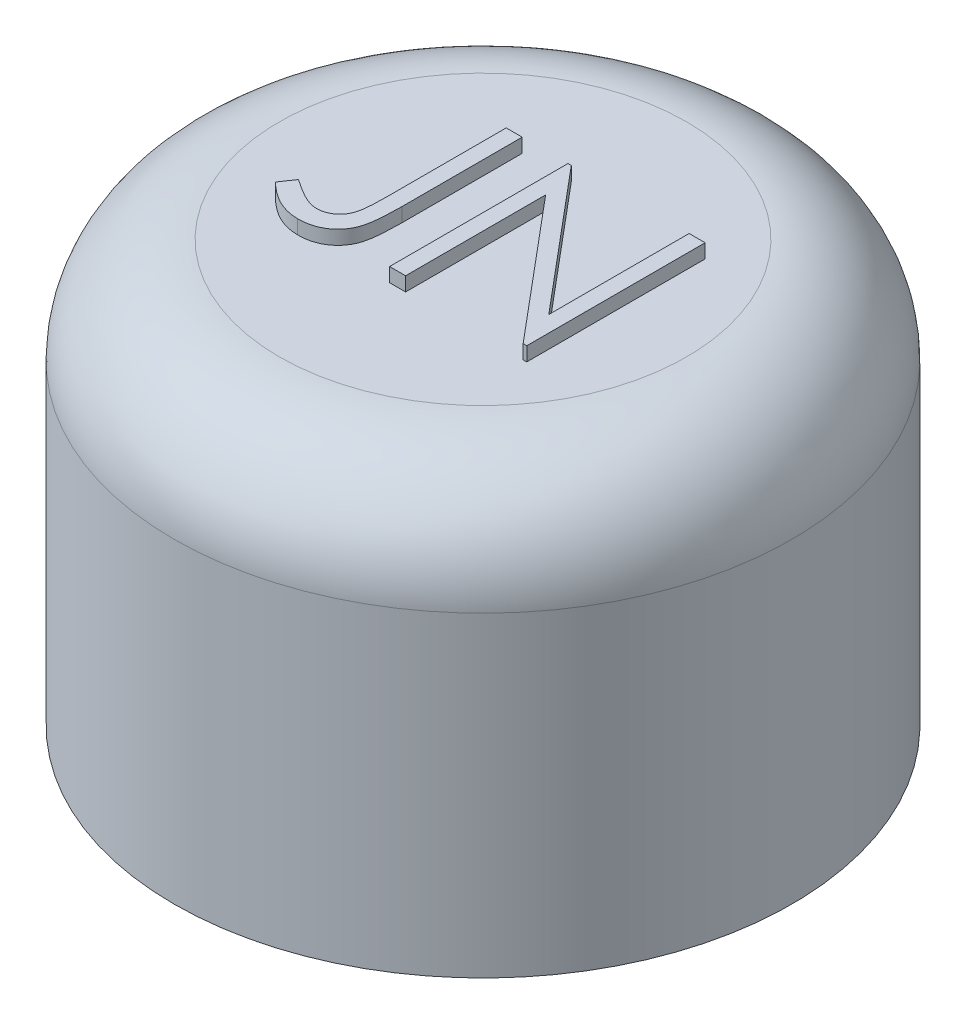
ISO-10303-21;
HEADER;
FILE_DESCRIPTION(('STEP AP214'),'2;1');
FILE_NAME('part.step','',(''),(''),'','','');
FILE_SCHEMA(('AUTOMOTIVE_DESIGN { 1 0 10303 214 1 1 1 1 }'));
ENDSEC;
DATA;
#1=APPLICATION_CONTEXT('core data for automotive mechanical design processes');
#2=APPLICATION_PROTOCOL_DEFINITION('international standard','automotive_design',2000,#1);
#3=PRODUCT_CONTEXT('',#1,'mechanical');
#4=PRODUCT('Part','Part','',(#3));
#5=PRODUCT_RELATED_PRODUCT_CATEGORY('part','',(#4));
#6=PRODUCT_DEFINITION_FORMATION('','',#4);
#7=PRODUCT_DEFINITION_CONTEXT('part definition',#1,'design');
#8=PRODUCT_DEFINITION('design','',#6,#7);
#9=PRODUCT_DEFINITION_SHAPE('','',#8);
#10=(LENGTH_UNIT() NAMED_UNIT(*) SI_UNIT(.MILLI.,.METRE.));
#11=(NAMED_UNIT(*) PLANE_ANGLE_UNIT() SI_UNIT($,.RADIAN.));
#12=(NAMED_UNIT(*) SI_UNIT($,.STERADIAN.) SOLID_ANGLE_UNIT());
#13=UNCERTAINTY_MEASURE_WITH_UNIT(LENGTH_MEASURE(1.E-05),#10,'distance_accuracy_value','');
#14=(GEOMETRIC_REPRESENTATION_CONTEXT(3) GLOBAL_UNCERTAINTY_ASSIGNED_CONTEXT((#13)) GLOBAL_UNIT_ASSIGNED_CONTEXT((#10,
#11,#12)) REPRESENTATION_CONTEXT('',''));
#15=CARTESIAN_POINT('',(0.,0.,0.));
#16=DIRECTION('',(0.,0.,1.));
#17=DIRECTION('',(1.,0.,0.));
#18=AXIS2_PLACEMENT_3D('',#15,#16,#17);
#19=CARTESIAN_POINT('',(0.,0.,0.));
#20=DIRECTION('',(0.,1.,0.));
#21=DIRECTION('',(0.,0.,1.));
#22=AXIS2_PLACEMENT_3D('',#19,#20,#21);
#23=CYLINDRICAL_SURFACE('',#22,22.);
#24=CARTESIAN_POINT('',(0.,22.5,0.));
#25=DIRECTION('',(0.,1.,0.));
#26=DIRECTION('',(0.,0.,1.));
#27=AXIS2_PLACEMENT_3D('',#24,#25,#26);
#28=CIRCLE('',#27,22.);
#29=CARTESIAN_POINT('',(0.,22.5,22.));
#30=VERTEX_POINT('',#29);
#31=EDGE_CURVE('E11',#30,#30,#28,.F.);
#32=ORIENTED_EDGE('',*,*,#31,.T.);
#33=EDGE_LOOP('',(#32));
#34=FACE_BOUND('',#33,.T.);
#35=CARTESIAN_POINT('',(0.,0.,0.));
#36=DIRECTION('',(0.,1.,0.));
#37=DIRECTION('',(0.,0.,1.));
#38=AXIS2_PLACEMENT_3D('',#35,#36,#37);
#39=CIRCLE('',#38,22.);
#40=CARTESIAN_POINT('',(0.,0.,22.));
#41=VERTEX_POINT('',#40);
#42=EDGE_CURVE('E327',#41,#41,#39,.T.);
#43=ORIENTED_EDGE('',*,*,#42,.T.);
#44=EDGE_LOOP('',(#43));
#45=FACE_BOUND('',#44,.T.);
#46=ADVANCED_FACE('F37',(#34,#45),#23,.T.);
#47=CARTESIAN_POINT('',(0.,0.,0.));
#48=DIRECTION('',(0.,1.,0.));
#49=DIRECTION('',(0.,0.,1.));
#50=AXIS2_PLACEMENT_3D('',#47,#48,#49);
#51=PLANE('',#50);
#52=CARTESIAN_POINT('',(-11.2583302491977,0.,-6.50000000000002));
#53=DIRECTION('',(0.,1.,0.));
#54=DIRECTION('',(0.,0.,1.));
#55=AXIS2_PLACEMENT_3D('',#52,#53,#54);
#56=CIRCLE('',#55,4.5);
#57=CARTESIAN_POINT('',(-11.2583302491977,0.,-2.00000000000002));
#58=VERTEX_POINT('',#57);
#59=EDGE_CURVE('E337',#58,#58,#56,.T.);
#60=ORIENTED_EDGE('',*,*,#59,.T.);
#61=EDGE_LOOP('',(#60));
#62=FACE_BOUND('',#61,.T.);
#63=CARTESIAN_POINT('',(-11.2583302491977,0.,6.50000000000005));
#64=DIRECTION('',(0.,1.,0.));
#65=DIRECTION('',(0.,0.,1.));
#66=AXIS2_PLACEMENT_3D('',#63,#64,#65);
#67=CIRCLE('',#66,4.5);
#68=CARTESIAN_POINT('',(-11.2583302491977,0.,11.));
#69=VERTEX_POINT('',#68);
#70=EDGE_CURVE('E355',#69,#69,#67,.T.);
#71=ORIENTED_EDGE('',*,*,#70,.T.);
#72=EDGE_LOOP('',(#71));
#73=FACE_BOUND('',#72,.T.);
#74=CARTESIAN_POINT('',(11.2583302491977,0.,-6.5));
#75=DIRECTION('',(0.,1.,0.));
#76=DIRECTION('',(0.,0.,1.));
#77=AXIS2_PLACEMENT_3D('',#74,#75,#76);
#78=CIRCLE('',#77,4.5);
#79=CARTESIAN_POINT('',(11.2583302491977,0.,-2.));
#80=VERTEX_POINT('',#79);
#81=EDGE_CURVE('E349',#80,#80,#78,.T.);
#82=ORIENTED_EDGE('',*,*,#81,.T.);
#83=EDGE_LOOP('',(#82));
#84=FACE_BOUND('',#83,.T.);
#85=CARTESIAN_POINT('',(11.2583302491977,0.,6.50000000000002));
#86=DIRECTION('',(0.,1.,0.));
#87=DIRECTION('',(0.,0.,1.));
#88=AXIS2_PLACEMENT_3D('',#85,#86,#87);
#89=CIRCLE('',#88,4.5);
#90=CARTESIAN_POINT('',(11.2583302491977,0.,11.));
#91=VERTEX_POINT('',#90);
#92=EDGE_CURVE('E342',#91,#91,#89,.T.);
#93=ORIENTED_EDGE('',*,*,#92,.T.);
#94=EDGE_LOOP('',(#93));
#95=FACE_BOUND('',#94,.T.);
#96=CARTESIAN_POINT('',(0.,0.,13.));
#97=DIRECTION('',(0.,1.,0.));
#98=DIRECTION('',(0.,0.,1.));
#99=AXIS2_PLACEMENT_3D('',#96,#97,#98);
#100=CIRCLE('',#99,4.5);
#101=CARTESIAN_POINT('',(0.,0.,17.5));
#102=VERTEX_POINT('',#101);
#103=EDGE_CURVE('E343',#102,#102,#100,.T.);
#104=ORIENTED_EDGE('',*,*,#103,.T.);
#105=EDGE_LOOP('',(#104));
#106=FACE_BOUND('',#105,.T.);
#107=CARTESIAN_POINT('',(0.,0.,-13.));
#108=DIRECTION('',(0.,1.,0.));
#109=DIRECTION('',(0.,0.,1.));
#110=AXIS2_PLACEMENT_3D('',#107,#108,#109);
#111=CIRCLE('',#110,4.5);
#112=CARTESIAN_POINT('',(0.,0.,-8.5));
#113=VERTEX_POINT('',#112);
#114=EDGE_CURVE('E333',#113,#113,#111,.T.);
#115=ORIENTED_EDGE('',*,*,#114,.T.);
#116=EDGE_LOOP('',(#115));
#117=FACE_BOUND('',#116,.T.);
#118=ORIENTED_EDGE('',*,*,#42,.F.);
#119=EDGE_LOOP('',(#118));
#120=FACE_BOUND('',#119,.T.);
#121=ADVANCED_FACE('F314',(#62,#73,#84,#95,#106,#117,#120),#51,.F.);
#122=CARTESIAN_POINT('',(0.,30.,0.));
#123=DIRECTION('',(0.,1.,0.));
#124=DIRECTION('',(0.,0.,1.));
#125=AXIS2_PLACEMENT_3D('',#122,#123,#124);
#126=PLANE('',#125);
#127=DIRECTION('',(-1.,0.,0.));
#128=VECTOR('',#127,1.);
#129=CARTESIAN_POINT('',(0.488461538461539,30.,6.));
#130=LINE('',#129,#128);
#131=CARTESIAN_POINT('',(0.488461538461539,30.,6.));
#132=VERTEX_POINT('',#131);
#133=CARTESIAN_POINT('',(-0.651282051282051,30.,6.));
#134=VERTEX_POINT('',#133);
#135=EDGE_CURVE('E165',#132,#134,#130,.T.);
#136=ORIENTED_EDGE('',*,*,#135,.T.);
#137=DIRECTION('',(0.,0.,-1.));
#138=VECTOR('',#137,1.);
#139=CARTESIAN_POINT('',(-0.651282051282051,30.,6.));
#140=LINE('',#139,#138);
#141=CARTESIAN_POINT('',(-0.651282051282051,30.,-6.7));
#142=VERTEX_POINT('',#141);
#143=EDGE_CURVE('E170',#134,#142,#140,.T.);
#144=ORIENTED_EDGE('',*,*,#143,.T.);
#145=DIRECTION('',(1.,0.,0.));
#146=VECTOR('',#145,1.);
#147=CARTESIAN_POINT('',(-0.651282051282051,30.,-6.7));
#148=LINE('',#147,#146);
#149=CARTESIAN_POINT('',(-0.412139423076922,30.,-6.7));
#150=VERTEX_POINT('',#149);
#151=EDGE_CURVE('E188',#142,#150,#148,.T.);
#152=ORIENTED_EDGE('',*,*,#151,.T.);
#153=DIRECTION('',(0.642922308187064,0.,0.76593139747331));
#154=VECTOR('',#153,1.);
#155=CARTESIAN_POINT('',(-0.412139423076922,30.,-6.7));
#156=LINE('',#155,#154);
#157=CARTESIAN_POINT('',(7.97820512820513,30.,3.29565304487179));
#158=VERTEX_POINT('',#157);
#159=EDGE_CURVE('E190',#150,#158,#156,.T.);
#160=ORIENTED_EDGE('',*,*,#159,.T.);
#161=DIRECTION('',(0.,0.,-1.));
#162=VECTOR('',#161,1.);
#163=CARTESIAN_POINT('',(7.97820512820513,30.,3.29565304487179));
#164=LINE('',#163,#162);
#165=CARTESIAN_POINT('',(7.97820512820513,30.,-6.7));
#166=VERTEX_POINT('',#165);
#167=EDGE_CURVE('E869',#158,#166,#164,.T.);
#168=ORIENTED_EDGE('',*,*,#167,.T.);
#169=DIRECTION('',(1.,0.,0.));
#170=VECTOR('',#169,1.);
#171=CARTESIAN_POINT('',(7.97820512820513,30.,-6.7));
#172=LINE('',#171,#170);
#173=CARTESIAN_POINT('',(9.11794871794872,30.,-6.7));
#174=VERTEX_POINT('',#173);
#175=EDGE_CURVE('E867',#166,#174,#172,.T.);
#176=ORIENTED_EDGE('',*,*,#175,.T.);
#177=DIRECTION('',(0.,0.,1.));
#178=VECTOR('',#177,1.);
#179=CARTESIAN_POINT('',(9.11794871794872,30.,-6.7));
#180=LINE('',#179,#178);
#181=CARTESIAN_POINT('',(9.11794871794872,30.,6.));
#182=VERTEX_POINT('',#181);
#183=EDGE_CURVE('E865',#174,#182,#180,.T.);
#184=ORIENTED_EDGE('',*,*,#183,.T.);
#185=DIRECTION('',(-1.,0.,0.));
#186=VECTOR('',#185,1.);
#187=CARTESIAN_POINT('',(9.11794871794872,30.,6.));
#188=LINE('',#187,#186);
#189=CARTESIAN_POINT('',(8.85845352564103,30.,6.));
#190=VERTEX_POINT('',#189);
#191=EDGE_CURVE('E851',#182,#190,#188,.T.);
#192=ORIENTED_EDGE('',*,*,#191,.T.);
#193=DIRECTION('',(-0.642871248750166,0.,-0.765974253829985));
#194=VECTOR('',#193,1.);
#195=CARTESIAN_POINT('',(8.85845352564103,30.,6.));
#196=LINE('',#195,#194);
#197=CARTESIAN_POINT('',(0.488461538461539,30.,-3.97275641025641));
#198=VERTEX_POINT('',#197);
#199=EDGE_CURVE('E57',#190,#198,#196,.T.);
#200=ORIENTED_EDGE('',*,*,#199,.T.);
#201=DIRECTION('',(0.,0.,1.));
#202=VECTOR('',#201,1.);
#203=CARTESIAN_POINT('',(0.488461538461539,30.,-3.97275641025641));
#204=LINE('',#203,#202);
#205=EDGE_CURVE('E52',#198,#132,#204,.T.);
#206=ORIENTED_EDGE('',*,*,#205,.T.);
#207=EDGE_LOOP('',(#136,#144,#152,#160,#168,#176,#184,#192,#200,#206));
#208=FACE_BOUND('',#207,.T.);
#209=DIRECTION('',(0.,0.,-1.));
#210=VECTOR('',#209,1.);
#211=CARTESIAN_POINT('',(-5.0474358974359,30.,1.74885817307692));
#212=LINE('',#211,#210);
#213=CARTESIAN_POINT('',(-5.0474358974359,30.,1.74885817307692));
#214=VERTEX_POINT('',#213);
#215=CARTESIAN_POINT('',(-5.0474358974359,30.,-6.7));
#216=VERTEX_POINT('',#215);
#217=EDGE_CURVE('E173',#214,#216,#212,.T.);
#218=ORIENTED_EDGE('',*,*,#217,.T.);
#219=DIRECTION('',(1.,0.,0.));
#220=VECTOR('',#219,1.);
#221=CARTESIAN_POINT('',(-5.0474358974359,30.,-6.7));
#222=LINE('',#221,#220);
#223=CARTESIAN_POINT('',(-3.90769230769231,30.,-6.7));
#224=VERTEX_POINT('',#223);
#225=EDGE_CURVE('E434',#216,#224,#222,.T.);
#226=ORIENTED_EDGE('',*,*,#225,.T.);
#227=DIRECTION('',(0.,0.,1.));
#228=VECTOR('',#227,1.);
#229=CARTESIAN_POINT('',(-3.90769230769231,30.,-6.7));
#230=LINE('',#229,#228);
#231=CARTESIAN_POINT('',(-3.90769230769231,30.,1.87606169871795));
#232=VERTEX_POINT('',#231);
#233=EDGE_CURVE('E429',#224,#232,#230,.T.);
#234=ORIENTED_EDGE('',*,*,#233,.T.);
#235=CARTESIAN_POINT('',(-3.90769230769231,30.,1.87606169871795));
#236=CARTESIAN_POINT('',(-3.90883138387066,30.,2.03464903311119));
#237=CARTESIAN_POINT('',(-3.91101854912764,30.,2.33915606659677));
#238=CARTESIAN_POINT('',(-3.9230451244991,30.,2.77775563168928));
#239=CARTESIAN_POINT('',(-3.94530088718839,30.,3.17824355019901));
#240=CARTESIAN_POINT('',(-3.97772221822161,30.,3.5415304864298));
#241=CARTESIAN_POINT('',(-4.02097563446731,30.,3.86647832990258));
#242=CARTESIAN_POINT('',(-4.07047307935991,30.,4.15559788597355));
#243=CARTESIAN_POINT('',(-4.13039094920373,30.,4.40647616184887));
#244=CARTESIAN_POINT('',(-4.22062069846226,30.,4.68818159552638));
#245=CARTESIAN_POINT('',(-4.36857188318675,30.,4.99713197270175));
#246=CARTESIAN_POINT('',(-4.5912465644556,30.,5.33079780490005));
#247=CARTESIAN_POINT('',(-4.8678627115185,30.,5.62265618068831));
#248=CARTESIAN_POINT('',(-5.1882693176073,30.,5.87612178252522));
#249=CARTESIAN_POINT('',(-5.55526674783971,30.,6.07807802136503));
#250=CARTESIAN_POINT('',(-5.96129742866163,30.,6.22305824016628));
#251=CARTESIAN_POINT('',(-6.40386190311582,30.,6.31148963420295));
#252=CARTESIAN_POINT('',(-6.71083618793734,30.,6.32082923269824));
#253=CARTESIAN_POINT('',(-6.86899038461539,30.,6.32564102564103));
#254=B_SPLINE_CURVE_WITH_KNOTS('',3,(#235,#236,#237,#238,#239,#240,#241,#242,#243,#244,#245,
#246,#247,#248,#249,#250,#251,#252,#253),.UNSPECIFIED.,.F.,.F.,(4,1,1,1,1,1,1,1,1,1,1,1,1,1,1,1,
4),(0.,0.0773606839426993,0.148541953025043,0.214007737252134,0.272994503360687,
0.326409195767468,0.373880400729808,0.416019938265759,0.452125519512633,0.518001710705456,
0.582366929733514,0.647043782341806,0.713330421064473,0.780911970350968,0.850394959130645,
0.922922973592277,1.),.UNSPECIFIED.);
#255=CARTESIAN_POINT('',(-6.86899038461539,30.,6.32564102564103));
#256=VERTEX_POINT('',#255);
#257=EDGE_CURVE('E422',#232,#256,#254,.T.);
#258=ORIENTED_EDGE('',*,*,#257,.T.);
#259=CARTESIAN_POINT('',(-6.86899038461539,30.,6.32564102564103));
#260=CARTESIAN_POINT('',(-6.99221071317152,30.,6.32171995822976));
#261=CARTESIAN_POINT('',(-7.24013817545859,30.,6.31383051089487));
#262=CARTESIAN_POINT('',(-7.60913017582421,30.,6.24952600925739));
#263=CARTESIAN_POINT('',(-7.9770744882193,30.,6.15040779482913));
#264=CARTESIAN_POINT('',(-8.34592403115386,30.,6.00525552009667));
#265=CARTESIAN_POINT('',(-8.72296613547378,30.,5.80784091988114));
#266=CARTESIAN_POINT('',(-9.11330733633349,30.,5.54954172829436));
#267=CARTESIAN_POINT('',(-9.52196862924131,30.,5.23083876108125));
#268=CARTESIAN_POINT('',(-9.79114798168583,30.,4.987587512732));
#269=CARTESIAN_POINT('',(-9.93205128205128,30.,4.86025641025641));
#270=B_SPLINE_CURVE_WITH_KNOTS('',3,(#259,#260,#261,#262,#263,#264,#265,#266,#267,#268,#269),
.UNSPECIFIED.,.F.,.F.,(4,1,1,1,1,1,1,1,4),(0.,0.106070902105129,0.213421680412451,
0.321685488130325,0.433857939098158,0.554081282774355,0.687587043966562,0.836465850065113,1.),.UNSPECIFIED.);
#271=CARTESIAN_POINT('',(-9.93205128205128,30.,4.86025641025641));
#272=VERTEX_POINT('',#271);
#273=EDGE_CURVE('E418',#256,#272,#270,.T.);
#274=ORIENTED_EDGE('',*,*,#273,.T.);
#275=DIRECTION('',(0.566528822887066,0.,-0.824041924199368));
#276=VECTOR('',#275,1.);
#277=CARTESIAN_POINT('',(-9.93205128205128,30.,4.86025641025641));
#278=LINE('',#277,#276);
#279=CARTESIAN_POINT('',(-9.26041666666667,30.,3.88333333333334));
#280=VERTEX_POINT('',#279);
#281=EDGE_CURVE('E413',#272,#280,#278,.T.);
#282=ORIENTED_EDGE('',*,*,#281,.T.);
#283=CARTESIAN_POINT('',(-9.26041666666667,30.,3.88333333333333));
#284=CARTESIAN_POINT('',(-9.10546694564212,30.,3.99018531379693));
#285=CARTESIAN_POINT('',(-8.81290166815107,30.,4.19193578555059));
#286=CARTESIAN_POINT('',(-8.38289983979292,30.,4.45147516429383));
#287=CARTESIAN_POINT('',(-8.00191017031415,30.,4.67399790788779));
#288=CARTESIAN_POINT('',(-7.75268919001558,30.,4.78739903487742));
#289=CARTESIAN_POINT('',(-7.63729967948718,30.,4.83990384615385));
#290=B_SPLINE_CURVE_WITH_KNOTS('',3,(#283,#284,#285,#286,#287,#288,#289),.UNSPECIFIED.,.F.,.F.,
(4,1,1,1,4),(0.,0.299184287676538,0.564898946356809,0.79854786884262,1.),.UNSPECIFIED.);
#291=CARTESIAN_POINT('',(-7.63729967948718,30.,4.83990384615385));
#292=VERTEX_POINT('',#291);
#293=EDGE_CURVE('E406',#280,#292,#290,.T.);
#294=ORIENTED_EDGE('',*,*,#293,.T.);
#295=CARTESIAN_POINT('',(-7.63729967948718,30.,4.83990384615385));
#296=CARTESIAN_POINT('',(-7.56732517754408,30.,4.86733387707247));
#297=CARTESIAN_POINT('',(-7.43008959716454,30.,4.9211302758808));
#298=CARTESIAN_POINT('',(-7.22026716522807,30.,4.98116824975235));
#299=CARTESIAN_POINT('',(-7.01164231682584,30.,5.01397928003401));
#300=CARTESIAN_POINT('',(-6.873329541938,30.,5.02008011742272));
#301=CARTESIAN_POINT('',(-6.80538862179487,30.,5.02307692307692));
#302=B_SPLINE_CURVE_WITH_KNOTS('',3,(#295,#296,#297,#298,#299,#300,#301),.UNSPECIFIED.,.F.,.F.,
(4,1,1,1,4),(0.,0.262951625567487,0.515706692358362,0.762109226953107,1.),.UNSPECIFIED.);
#303=CARTESIAN_POINT('',(-6.80538862179487,30.,5.02307692307692));
#304=VERTEX_POINT('',#303);
#305=EDGE_CURVE('E399',#292,#304,#302,.T.);
#306=ORIENTED_EDGE('',*,*,#305,.T.);
#307=CARTESIAN_POINT('',(-6.80538862179487,30.,5.02307692307692));
#308=CARTESIAN_POINT('',(-6.71763964664394,30.,5.01936585631649));
#309=CARTESIAN_POINT('',(-6.54419227671802,30.,5.01203044563949));
#310=CARTESIAN_POINT('',(-6.29213721274558,30.,4.94726307536936));
#311=CARTESIAN_POINT('',(-6.05098949949865,30.,4.84840481300511));
#312=CARTESIAN_POINT('',(-5.82939388448474,30.,4.70365640419528));
#313=CARTESIAN_POINT('',(-5.62515833707329,30.,4.53154810622828));
#314=CARTESIAN_POINT('',(-5.45663722708502,30.,4.32342773192467));
#315=CARTESIAN_POINT('',(-5.31614893995384,30.,4.09277401852993));
#316=CARTESIAN_POINT('',(-5.23160433836765,30.,3.87443760030299));
#317=CARTESIAN_POINT('',(-5.17773902278479,30.,3.67531382759765));
#318=CARTESIAN_POINT('',(-5.14355197676033,30.,3.49231359170058));
#319=CARTESIAN_POINT('',(-5.11365740905482,30.,3.27836765542569));
#320=CARTESIAN_POINT('',(-5.08759863501236,30.,3.03322064287199));
#321=CARTESIAN_POINT('',(-5.07234241326842,30.,2.75638175342214));
#322=CARTESIAN_POINT('',(-5.05522545187528,30.,2.44866386336382));
#323=CARTESIAN_POINT('',(-5.04903779093275,30.,2.10929115339514));
#324=CARTESIAN_POINT('',(-5.04798615520576,30.,1.87266855642918));
#325=CARTESIAN_POINT('',(-5.0474358974359,30.,1.74885817307692));
#326=B_SPLINE_CURVE_WITH_KNOTS('',3,(#307,#308,#309,#310,#311,#312,#313,#314,#315,#316,#317,
#318,#319,#320,#321,#322,#323,#324,#325),.UNSPECIFIED.,.F.,.F.,(4,1,1,1,1,1,1,1,1,1,1,1,1,1,1,1,
4),(0.,0.0623263659914399,0.123196245194447,0.184036220254551,0.246964085428892,
0.310699395789571,0.373267637073443,0.436587579967389,0.502124791036648,0.539004722034163,
0.583255375525985,0.634446515282812,0.692676046102116,0.758570486286528,0.831658674792115,
0.911917102274834,1.),.UNSPECIFIED.);
#327=EDGE_CURVE('E224',#304,#214,#326,.T.);
#328=ORIENTED_EDGE('',*,*,#327,.T.);
#329=EDGE_LOOP('',(#218,#226,#234,#258,#274,#282,#294,#306,#328));
#330=FACE_BOUND('',#329,.T.);
#331=CARTESIAN_POINT('',(0.,30.,0.));
#332=DIRECTION('',(0.,1.,0.));
#333=DIRECTION('',(0.,0.,1.));
#334=AXIS2_PLACEMENT_3D('',#331,#332,#333);
#335=CIRCLE('',#334,14.5);
#336=CARTESIAN_POINT('',(0.,30.,14.5));
#337=VERTEX_POINT('',#336);
#338=EDGE_CURVE('E45',#337,#337,#335,.T.);
#339=ORIENTED_EDGE('',*,*,#338,.T.);
#340=EDGE_LOOP('',(#339));
#341=FACE_BOUND('',#340,.T.);
#342=ADVANCED_FACE('F167',(#208,#330,#341),#126,.T.);
#343=CARTESIAN_POINT('',(0.,25.,-13.));
#344=DIRECTION('',(0.,-1.,0.));
#345=DIRECTION('',(0.,0.,-1.));
#346=AXIS2_PLACEMENT_3D('',#343,#344,#345);
#347=CYLINDRICAL_SURFACE('',#346,4.5);
#348=CARTESIAN_POINT('',(0.,25.,-13.));
#349=DIRECTION('',(0.,1.,0.));
#350=DIRECTION('',(0.,0.,1.));
#351=AXIS2_PLACEMENT_3D('',#348,#349,#350);
#352=CIRCLE('',#351,4.5);
#353=CARTESIAN_POINT('',(0.,25.,-8.5));
#354=VERTEX_POINT('',#353);
#355=EDGE_CURVE('E329',#354,#354,#352,.T.);
#356=ORIENTED_EDGE('',*,*,#355,.T.);
#357=EDGE_LOOP('',(#356));
#358=FACE_BOUND('',#357,.T.);
#359=ORIENTED_EDGE('',*,*,#114,.F.);
#360=EDGE_LOOP('',(#359));
#361=FACE_BOUND('',#360,.T.);
#362=ADVANCED_FACE('F309',(#358,#361),#347,.F.);
#363=CARTESIAN_POINT('',(0.,25.,-13.));
#364=DIRECTION('',(0.,1.,0.));
#365=DIRECTION('',(0.,0.,1.));
#366=AXIS2_PLACEMENT_3D('',#363,#364,#365);
#367=PLANE('',#366);
#368=ORIENTED_EDGE('',*,*,#355,.F.);
#369=EDGE_LOOP('',(#368));
#370=FACE_BOUND('',#369,.T.);
#371=ADVANCED_FACE('F270',(#370),#367,.F.);
#372=CARTESIAN_POINT('',(0.,25.,13.));
#373=DIRECTION('',(0.,-1.,0.));
#374=DIRECTION('',(0.,0.,-1.));
#375=AXIS2_PLACEMENT_3D('',#372,#373,#374);
#376=CYLINDRICAL_SURFACE('',#375,4.5);
#377=CARTESIAN_POINT('',(0.,25.,13.));
#378=DIRECTION('',(0.,1.,0.));
#379=DIRECTION('',(0.,0.,1.));
#380=AXIS2_PLACEMENT_3D('',#377,#378,#379);
#381=CIRCLE('',#380,4.5);
#382=CARTESIAN_POINT('',(0.,25.,17.5));
#383=VERTEX_POINT('',#382);
#384=EDGE_CURVE('E363',#383,#383,#381,.T.);
#385=ORIENTED_EDGE('',*,*,#384,.T.);
#386=EDGE_LOOP('',(#385));
#387=FACE_BOUND('',#386,.T.);
#388=ORIENTED_EDGE('',*,*,#103,.F.);
#389=EDGE_LOOP('',(#388));
#390=FACE_BOUND('',#389,.T.);
#391=ADVANCED_FACE('F266',(#387,#390),#376,.F.);
#392=CARTESIAN_POINT('',(0.,25.,13.));
#393=DIRECTION('',(0.,1.,0.));
#394=DIRECTION('',(0.,0.,1.));
#395=AXIS2_PLACEMENT_3D('',#392,#393,#394);
#396=PLANE('',#395);
#397=ORIENTED_EDGE('',*,*,#384,.F.);
#398=EDGE_LOOP('',(#397));
#399=FACE_BOUND('',#398,.T.);
#400=ADVANCED_FACE('F269',(#399),#396,.F.);
#401=CARTESIAN_POINT('',(11.2583302491977,25.,6.50000000000002));
#402=DIRECTION('',(0.,-1.,0.));
#403=DIRECTION('',(0.,0.,-1.));
#404=AXIS2_PLACEMENT_3D('',#401,#402,#403);
#405=CYLINDRICAL_SURFACE('',#404,4.5);
#406=CARTESIAN_POINT('',(11.2583302491977,25.,6.50000000000002));
#407=DIRECTION('',(0.,1.,0.));
#408=DIRECTION('',(0.,0.,1.));
#409=AXIS2_PLACEMENT_3D('',#406,#407,#408);
#410=CIRCLE('',#409,4.5);
#411=CARTESIAN_POINT('',(11.2583302491977,25.,11.));
#412=VERTEX_POINT('',#411);
#413=EDGE_CURVE('E339',#412,#412,#410,.T.);
#414=ORIENTED_EDGE('',*,*,#413,.T.);
#415=EDGE_LOOP('',(#414));
#416=FACE_BOUND('',#415,.T.);
#417=ORIENTED_EDGE('',*,*,#92,.F.);
#418=EDGE_LOOP('',(#417));
#419=FACE_BOUND('',#418,.T.);
#420=ADVANCED_FACE('F274',(#416,#419),#405,.F.);
#421=CARTESIAN_POINT('',(11.2583302491977,25.,6.50000000000002));
#422=DIRECTION('',(0.,1.,0.));
#423=DIRECTION('',(0.,0.,1.));
#424=AXIS2_PLACEMENT_3D('',#421,#422,#423);
#425=PLANE('',#424);
#426=ORIENTED_EDGE('',*,*,#413,.F.);
#427=EDGE_LOOP('',(#426));
#428=FACE_BOUND('',#427,.T.);
#429=ADVANCED_FACE('F296',(#428),#425,.F.);
#430=CARTESIAN_POINT('',(11.2583302491977,25.,-6.5));
#431=DIRECTION('',(0.,-1.,0.));
#432=DIRECTION('',(0.,0.,-1.));
#433=AXIS2_PLACEMENT_3D('',#430,#431,#432);
#434=CYLINDRICAL_SURFACE('',#433,4.5);
#435=CARTESIAN_POINT('',(11.2583302491977,25.,-6.5));
#436=DIRECTION('',(0.,1.,0.));
#437=DIRECTION('',(0.,0.,1.));
#438=AXIS2_PLACEMENT_3D('',#435,#436,#437);
#439=CIRCLE('',#438,4.5);
#440=CARTESIAN_POINT('',(11.2583302491977,25.,-2.));
#441=VERTEX_POINT('',#440);
#442=EDGE_CURVE('E346',#441,#441,#439,.T.);
#443=ORIENTED_EDGE('',*,*,#442,.T.);
#444=EDGE_LOOP('',(#443));
#445=FACE_BOUND('',#444,.T.);
#446=ORIENTED_EDGE('',*,*,#81,.F.);
#447=EDGE_LOOP('',(#446));
#448=FACE_BOUND('',#447,.T.);
#449=ADVANCED_FACE('F293',(#445,#448),#434,.F.);
#450=CARTESIAN_POINT('',(11.2583302491977,25.,-6.5));
#451=DIRECTION('',(0.,1.,0.));
#452=DIRECTION('',(0.,0.,1.));
#453=AXIS2_PLACEMENT_3D('',#450,#451,#452);
#454=PLANE('',#453);
#455=ORIENTED_EDGE('',*,*,#442,.F.);
#456=EDGE_LOOP('',(#455));
#457=FACE_BOUND('',#456,.T.);
#458=ADVANCED_FACE('F288',(#457),#454,.F.);
#459=CARTESIAN_POINT('',(-11.2583302491977,25.,6.50000000000005));
#460=DIRECTION('',(0.,-1.,0.));
#461=DIRECTION('',(0.,0.,-1.));
#462=AXIS2_PLACEMENT_3D('',#459,#460,#461);
#463=CYLINDRICAL_SURFACE('',#462,4.5);
#464=CARTESIAN_POINT('',(-11.2583302491977,25.,6.50000000000005));
#465=DIRECTION('',(0.,1.,0.));
#466=DIRECTION('',(0.,0.,1.));
#467=AXIS2_PLACEMENT_3D('',#464,#465,#466);
#468=CIRCLE('',#467,4.5);
#469=CARTESIAN_POINT('',(-11.2583302491977,25.,11.));
#470=VERTEX_POINT('',#469);
#471=EDGE_CURVE('E352',#470,#470,#468,.T.);
#472=ORIENTED_EDGE('',*,*,#471,.T.);
#473=EDGE_LOOP('',(#472));
#474=FACE_BOUND('',#473,.T.);
#475=ORIENTED_EDGE('',*,*,#70,.F.);
#476=EDGE_LOOP('',(#475));
#477=FACE_BOUND('',#476,.T.);
#478=ADVANCED_FACE('F285',(#474,#477),#463,.F.);
#479=CARTESIAN_POINT('',(-11.2583302491977,25.,6.50000000000005));
#480=DIRECTION('',(0.,1.,0.));
#481=DIRECTION('',(0.,0.,1.));
#482=AXIS2_PLACEMENT_3D('',#479,#480,#481);
#483=PLANE('',#482);
#484=ORIENTED_EDGE('',*,*,#471,.F.);
#485=EDGE_LOOP('',(#484));
#486=FACE_BOUND('',#485,.T.);
#487=ADVANCED_FACE('F280',(#486),#483,.F.);
#488=CARTESIAN_POINT('',(-11.2583302491977,25.,-6.50000000000002));
#489=DIRECTION('',(0.,-1.,0.));
#490=DIRECTION('',(0.,0.,-1.));
#491=AXIS2_PLACEMENT_3D('',#488,#489,#490);
#492=CYLINDRICAL_SURFACE('',#491,4.5);
#493=CARTESIAN_POINT('',(-11.2583302491977,25.,-6.50000000000002));
#494=DIRECTION('',(0.,1.,0.));
#495=DIRECTION('',(0.,0.,1.));
#496=AXIS2_PLACEMENT_3D('',#493,#494,#495);
#497=CIRCLE('',#496,4.5);
#498=CARTESIAN_POINT('',(-11.2583302491977,25.,-2.00000000000002));
#499=VERTEX_POINT('',#498);
#500=EDGE_CURVE('E358',#499,#499,#497,.T.);
#501=ORIENTED_EDGE('',*,*,#500,.T.);
#502=EDGE_LOOP('',(#501));
#503=FACE_BOUND('',#502,.T.);
#504=ORIENTED_EDGE('',*,*,#59,.F.);
#505=EDGE_LOOP('',(#504));
#506=FACE_BOUND('',#505,.T.);
#507=ADVANCED_FACE('F276',(#503,#506),#492,.F.);
#508=CARTESIAN_POINT('',(-11.2583302491977,25.,-6.50000000000002));
#509=DIRECTION('',(0.,1.,0.));
#510=DIRECTION('',(0.,0.,1.));
#511=AXIS2_PLACEMENT_3D('',#508,#509,#510);
#512=PLANE('',#511);
#513=ORIENTED_EDGE('',*,*,#500,.F.);
#514=EDGE_LOOP('',(#513));
#515=FACE_BOUND('',#514,.T.);
#516=ADVANCED_FACE('F279',(#515),#512,.F.);
#517=CARTESIAN_POINT('',(0.,22.5,0.));
#518=DIRECTION('',(0.,1.,0.));
#519=DIRECTION('',(0.,0.,1.));
#520=AXIS2_PLACEMENT_3D('',#517,#518,#519);
#521=TOROIDAL_SURFACE('',#520,14.5,7.5);
#522=ORIENTED_EDGE('',*,*,#31,.F.);
#523=EDGE_LOOP('',(#522));
#524=FACE_BOUND('',#523,.T.);
#525=ORIENTED_EDGE('',*,*,#338,.F.);
#526=EDGE_LOOP('',(#525));
#527=FACE_BOUND('',#526,.T.);
#528=ADVANCED_FACE('F39',(#524,#527),#521,.T.);
#529=CARTESIAN_POINT('',(-5.0474358974359,31.,1.74885817307692));
#530=DIRECTION('',(-1.,0.,0.));
#531=DIRECTION('',(0.,0.,1.));
#532=AXIS2_PLACEMENT_3D('',#529,#530,#531);
#533=PLANE('',#532);
#534=ORIENTED_EDGE('',*,*,#217,.F.);
#535=DIRECTION('',(0.,-1.,0.));
#536=VECTOR('',#535,1.);
#537=CARTESIAN_POINT('',(-5.0474358974359,31.,1.74885817307692));
#538=LINE('',#537,#536);
#539=CARTESIAN_POINT('',(-5.0474358974359,31.,1.74885817307692));
#540=VERTEX_POINT('',#539);
#541=EDGE_CURVE('E366',#540,#214,#538,.T.);
#542=ORIENTED_EDGE('',*,*,#541,.F.);
#543=DIRECTION('',(0.,0.,-1.));
#544=VECTOR('',#543,1.);
#545=CARTESIAN_POINT('',(-5.0474358974359,31.,1.74885817307692));
#546=LINE('',#545,#544);
#547=CARTESIAN_POINT('',(-5.0474358974359,31.,-6.7));
#548=VERTEX_POINT('',#547);
#549=EDGE_CURVE('E220',#540,#548,#546,.T.);
#550=ORIENTED_EDGE('',*,*,#549,.T.);
#551=DIRECTION('',(0.,-1.,0.));
#552=VECTOR('',#551,1.);
#553=CARTESIAN_POINT('',(-5.0474358974359,31.,-6.7));
#554=LINE('',#553,#552);
#555=EDGE_CURVE('E369',#548,#216,#554,.T.);
#556=ORIENTED_EDGE('',*,*,#555,.T.);
#557=EDGE_LOOP('',(#534,#542,#550,#556));
#558=FACE_BOUND('',#557,.T.);
#559=ADVANCED_FACE('F261',(#558),#533,.T.);
#560=CARTESIAN_POINT('',(-6.80538862179487,31.,5.02307692307692));
#561=CARTESIAN_POINT('',(-6.71763964664394,31.,5.01936585631649));
#562=CARTESIAN_POINT('',(-6.54419227671802,31.,5.01203044563949));
#563=CARTESIAN_POINT('',(-6.29213721274558,31.,4.94726307536936));
#564=CARTESIAN_POINT('',(-6.05098949949865,31.,4.84840481300511));
#565=CARTESIAN_POINT('',(-5.82939388448474,31.,4.70365640419528));
#566=CARTESIAN_POINT('',(-5.62515833707329,31.,4.53154810622828));
#567=CARTESIAN_POINT('',(-5.45663722708502,31.,4.32342773192467));
#568=CARTESIAN_POINT('',(-5.31614893995384,31.,4.09277401852993));
#569=CARTESIAN_POINT('',(-5.23160433836765,31.,3.87443760030299));
#570=CARTESIAN_POINT('',(-5.17773902278479,31.,3.67531382759765));
#571=CARTESIAN_POINT('',(-5.14355197676033,31.,3.49231359170058));
#572=CARTESIAN_POINT('',(-5.11365740905482,31.,3.27836765542569));
#573=CARTESIAN_POINT('',(-5.08759863501236,31.,3.03322064287199));
#574=CARTESIAN_POINT('',(-5.07234241326842,31.,2.75638175342214));
#575=CARTESIAN_POINT('',(-5.05522545187528,31.,2.44866386336382));
#576=CARTESIAN_POINT('',(-5.04903779093275,31.,2.10929115339514));
#577=CARTESIAN_POINT('',(-5.04798615520576,31.,1.87266855642918));
#578=CARTESIAN_POINT('',(-5.0474358974359,31.,1.74885817307692));
#579=B_SPLINE_CURVE_WITH_KNOTS('',3,(#560,#561,#562,#563,#564,#565,#566,#567,#568,#569,#570,
#571,#572,#573,#574,#575,#576,#577,#578),.UNSPECIFIED.,.F.,.F.,(4,1,1,1,1,1,1,1,1,1,1,1,1,1,1,1,
4),(0.,0.0623263659914399,0.123196245194447,0.184036220254551,0.246964085428892,
0.310699395789571,0.373267637073443,0.436587579967389,0.502124791036648,0.539004722034163,
0.583255375525985,0.634446515282812,0.692676046102116,0.758570486286528,0.831658674792115,
0.911917102274834,1.),.UNSPECIFIED.);
#580=DIRECTION('',(0.,-1.,0.));
#581=VECTOR('',#580,1.);
#582=SURFACE_OF_LINEAR_EXTRUSION('',#579,#581);
#583=ORIENTED_EDGE('',*,*,#327,.F.);
#584=DIRECTION('',(0.,-1.,0.));
#585=VECTOR('',#584,1.);
#586=CARTESIAN_POINT('',(-6.80538862179487,31.,5.02307692307692));
#587=LINE('',#586,#585);
#588=CARTESIAN_POINT('',(-6.80538862179487,31.,5.02307692307692));
#589=VERTEX_POINT('',#588);
#590=EDGE_CURVE('E391',#589,#304,#587,.T.);
#591=ORIENTED_EDGE('',*,*,#590,.F.);
#592=EDGE_CURVE('E373',#589,#540,#579,.T.);
#593=ORIENTED_EDGE('',*,*,#592,.T.);
#594=ORIENTED_EDGE('',*,*,#541,.T.);
#595=EDGE_LOOP('',(#583,#591,#593,#594));
#596=FACE_BOUND('',#595,.T.);
#597=ADVANCED_FACE('F264',(#596),#582,.T.);
#598=CARTESIAN_POINT('',(-7.63729967948718,31.,4.83990384615385));
#599=CARTESIAN_POINT('',(-7.56732517754408,31.,4.86733387707247));
#600=CARTESIAN_POINT('',(-7.43008959716454,31.,4.9211302758808));
#601=CARTESIAN_POINT('',(-7.22026716522807,31.,4.98116824975235));
#602=CARTESIAN_POINT('',(-7.01164231682584,31.,5.01397928003401));
#603=CARTESIAN_POINT('',(-6.873329541938,31.,5.02008011742272));
#604=CARTESIAN_POINT('',(-6.80538862179487,31.,5.02307692307692));
#605=B_SPLINE_CURVE_WITH_KNOTS('',3,(#598,#599,#600,#601,#602,#603,#604),.UNSPECIFIED.,.F.,.F.,
(4,1,1,1,4),(0.,0.262951625567487,0.515706692358362,0.762109226953107,1.),.UNSPECIFIED.);
#606=DIRECTION('',(0.,-1.,0.));
#607=VECTOR('',#606,1.);
#608=SURFACE_OF_LINEAR_EXTRUSION('',#605,#607);
#609=ORIENTED_EDGE('',*,*,#305,.F.);
#610=DIRECTION('',(0.,-1.,0.));
#611=VECTOR('',#610,1.);
#612=CARTESIAN_POINT('',(-7.63729967948718,31.,4.83990384615385));
#613=LINE('',#612,#611);
#614=CARTESIAN_POINT('',(-7.63729967948718,31.,4.83990384615385));
#615=VERTEX_POINT('',#614);
#616=EDGE_CURVE('E388',#615,#292,#613,.T.);
#617=ORIENTED_EDGE('',*,*,#616,.F.);
#618=EDGE_CURVE('E442',#615,#589,#605,.T.);
#619=ORIENTED_EDGE('',*,*,#618,.T.);
#620=ORIENTED_EDGE('',*,*,#590,.T.);
#621=EDGE_LOOP('',(#609,#617,#619,#620));
#622=FACE_BOUND('',#621,.T.);
#623=ADVANCED_FACE('F454',(#622),#608,.T.);
#624=CARTESIAN_POINT('',(-9.26041666666667,31.,3.88333333333333));
#625=CARTESIAN_POINT('',(-9.10546694564212,31.,3.99018531379693));
#626=CARTESIAN_POINT('',(-8.81290166815107,31.,4.19193578555059));
#627=CARTESIAN_POINT('',(-8.38289983979292,31.,4.45147516429383));
#628=CARTESIAN_POINT('',(-8.00191017031415,31.,4.67399790788779));
#629=CARTESIAN_POINT('',(-7.75268919001558,31.,4.78739903487742));
#630=CARTESIAN_POINT('',(-7.63729967948718,31.,4.83990384615385));
#631=B_SPLINE_CURVE_WITH_KNOTS('',3,(#624,#625,#626,#627,#628,#629,#630),.UNSPECIFIED.,.F.,.F.,
(4,1,1,1,4),(0.,0.299184287676538,0.564898946356809,0.79854786884262,1.),.UNSPECIFIED.);
#632=DIRECTION('',(0.,-1.,0.));
#633=VECTOR('',#632,1.);
#634=SURFACE_OF_LINEAR_EXTRUSION('',#631,#633);
#635=ORIENTED_EDGE('',*,*,#293,.F.);
#636=DIRECTION('',(0.,-1.,0.));
#637=VECTOR('',#636,1.);
#638=CARTESIAN_POINT('',(-9.26041666666667,31.,3.88333333333333));
#639=LINE('',#638,#637);
#640=CARTESIAN_POINT('',(-9.26041666666667,31.,3.88333333333333));
#641=VERTEX_POINT('',#640);
#642=EDGE_CURVE('E385',#641,#280,#639,.T.);
#643=ORIENTED_EDGE('',*,*,#642,.F.);
#644=EDGE_CURVE('E464',#641,#615,#631,.T.);
#645=ORIENTED_EDGE('',*,*,#644,.T.);
#646=ORIENTED_EDGE('',*,*,#616,.T.);
#647=EDGE_LOOP('',(#635,#643,#645,#646));
#648=FACE_BOUND('',#647,.T.);
#649=ADVANCED_FACE('F459',(#648),#634,.T.);
#650=CARTESIAN_POINT('',(-9.93205128205128,31.,4.86025641025641));
#651=DIRECTION('',(-0.824041924199368,0.,-0.566528822887066));
#652=DIRECTION('',(-0.566528822887066,0.,0.824041924199368));
#653=AXIS2_PLACEMENT_3D('',#650,#651,#652);
#654=PLANE('',#653);
#655=ORIENTED_EDGE('',*,*,#281,.F.);
#656=DIRECTION('',(0.,-1.,0.));
#657=VECTOR('',#656,1.);
#658=CARTESIAN_POINT('',(-9.93205128205128,31.,4.86025641025641));
#659=LINE('',#658,#657);
#660=CARTESIAN_POINT('',(-9.93205128205128,31.,4.86025641025641));
#661=VERTEX_POINT('',#660);
#662=EDGE_CURVE('E382',#661,#272,#659,.T.);
#663=ORIENTED_EDGE('',*,*,#662,.F.);
#664=DIRECTION('',(0.566528822887066,0.,-0.824041924199368));
#665=VECTOR('',#664,1.);
#666=CARTESIAN_POINT('',(-9.93205128205128,31.,4.86025641025641));
#667=LINE('',#666,#665);
#668=EDGE_CURVE('E469',#661,#641,#667,.T.);
#669=ORIENTED_EDGE('',*,*,#668,.T.);
#670=ORIENTED_EDGE('',*,*,#642,.T.);
#671=EDGE_LOOP('',(#655,#663,#669,#670));
#672=FACE_BOUND('',#671,.T.);
#673=ADVANCED_FACE('F462',(#672),#654,.T.);
#674=CARTESIAN_POINT('',(-6.86899038461539,31.,6.32564102564103));
#675=CARTESIAN_POINT('',(-6.99221071317152,31.,6.32171995822976));
#676=CARTESIAN_POINT('',(-7.24013817545859,31.,6.31383051089487));
#677=CARTESIAN_POINT('',(-7.60913017582421,31.,6.24952600925739));
#678=CARTESIAN_POINT('',(-7.9770744882193,31.,6.15040779482913));
#679=CARTESIAN_POINT('',(-8.34592403115386,31.,6.00525552009667));
#680=CARTESIAN_POINT('',(-8.72296613547378,31.,5.80784091988114));
#681=CARTESIAN_POINT('',(-9.11330733633349,31.,5.54954172829436));
#682=CARTESIAN_POINT('',(-9.52196862924131,31.,5.23083876108125));
#683=CARTESIAN_POINT('',(-9.79114798168583,31.,4.987587512732));
#684=CARTESIAN_POINT('',(-9.93205128205128,31.,4.86025641025641));
#685=B_SPLINE_CURVE_WITH_KNOTS('',3,(#674,#675,#676,#677,#678,#679,#680,#681,#682,#683,#684),
.UNSPECIFIED.,.F.,.F.,(4,1,1,1,1,1,1,1,4),(0.,0.106070902105129,0.213421680412451,
0.321685488130325,0.433857939098158,0.554081282774355,0.687587043966562,0.836465850065113,1.),.UNSPECIFIED.);
#686=DIRECTION('',(0.,-1.,0.));
#687=VECTOR('',#686,1.);
#688=SURFACE_OF_LINEAR_EXTRUSION('',#685,#687);
#689=ORIENTED_EDGE('',*,*,#273,.F.);
#690=DIRECTION('',(0.,-1.,0.));
#691=VECTOR('',#690,1.);
#692=CARTESIAN_POINT('',(-6.86899038461539,31.,6.32564102564103));
#693=LINE('',#692,#691);
#694=CARTESIAN_POINT('',(-6.86899038461539,31.,6.32564102564103));
#695=VERTEX_POINT('',#694);
#696=EDGE_CURVE('E379',#695,#256,#693,.T.);
#697=ORIENTED_EDGE('',*,*,#696,.F.);
#698=EDGE_CURVE('E236',#695,#661,#685,.T.);
#699=ORIENTED_EDGE('',*,*,#698,.T.);
#700=ORIENTED_EDGE('',*,*,#662,.T.);
#701=EDGE_LOOP('',(#689,#697,#699,#700));
#702=FACE_BOUND('',#701,.T.);
#703=ADVANCED_FACE('F250',(#702),#688,.T.);
#704=CARTESIAN_POINT('',(-3.90769230769231,31.,1.87606169871795));
#705=CARTESIAN_POINT('',(-3.90883138387066,31.,2.03464903311119));
#706=CARTESIAN_POINT('',(-3.91101854912764,31.,2.33915606659677));
#707=CARTESIAN_POINT('',(-3.9230451244991,31.,2.77775563168928));
#708=CARTESIAN_POINT('',(-3.94530088718839,31.,3.17824355019901));
#709=CARTESIAN_POINT('',(-3.97772221822161,31.,3.5415304864298));
#710=CARTESIAN_POINT('',(-4.02097563446731,31.,3.86647832990258));
#711=CARTESIAN_POINT('',(-4.07047307935991,31.,4.15559788597355));
#712=CARTESIAN_POINT('',(-4.13039094920373,31.,4.40647616184887));
#713=CARTESIAN_POINT('',(-4.22062069846226,31.,4.68818159552638));
#714=CARTESIAN_POINT('',(-4.36857188318675,31.,4.99713197270175));
#715=CARTESIAN_POINT('',(-4.5912465644556,31.,5.33079780490005));
#716=CARTESIAN_POINT('',(-4.8678627115185,31.,5.62265618068831));
#717=CARTESIAN_POINT('',(-5.1882693176073,31.,5.87612178252522));
#718=CARTESIAN_POINT('',(-5.55526674783971,31.,6.07807802136503));
#719=CARTESIAN_POINT('',(-5.96129742866163,31.,6.22305824016628));
#720=CARTESIAN_POINT('',(-6.40386190311582,31.,6.31148963420295));
#721=CARTESIAN_POINT('',(-6.71083618793734,31.,6.32082923269824));
#722=CARTESIAN_POINT('',(-6.86899038461539,31.,6.32564102564103));
#723=B_SPLINE_CURVE_WITH_KNOTS('',3,(#704,#705,#706,#707,#708,#709,#710,#711,#712,#713,#714,
#715,#716,#717,#718,#719,#720,#721,#722),.UNSPECIFIED.,.F.,.F.,(4,1,1,1,1,1,1,1,1,1,1,1,1,1,1,1,
4),(0.,0.0773606839426993,0.148541953025043,0.214007737252134,0.272994503360687,
0.326409195767468,0.373880400729808,0.416019938265759,0.452125519512633,0.518001710705456,
0.582366929733514,0.647043782341806,0.713330421064473,0.780911970350968,0.850394959130645,
0.922922973592277,1.),.UNSPECIFIED.);
#724=DIRECTION('',(0.,-1.,0.));
#725=VECTOR('',#724,1.);
#726=SURFACE_OF_LINEAR_EXTRUSION('',#723,#725);
#727=ORIENTED_EDGE('',*,*,#257,.F.);
#728=DIRECTION('',(0.,-1.,0.));
#729=VECTOR('',#728,1.);
#730=CARTESIAN_POINT('',(-3.90769230769231,31.,1.87606169871795));
#731=LINE('',#730,#729);
#732=CARTESIAN_POINT('',(-3.90769230769231,31.,1.87606169871795));
#733=VERTEX_POINT('',#732);
#734=EDGE_CURVE('E376',#733,#232,#731,.T.);
#735=ORIENTED_EDGE('',*,*,#734,.F.);
#736=EDGE_CURVE('E230',#733,#695,#723,.T.);
#737=ORIENTED_EDGE('',*,*,#736,.T.);
#738=ORIENTED_EDGE('',*,*,#696,.T.);
#739=EDGE_LOOP('',(#727,#735,#737,#738));
#740=FACE_BOUND('',#739,.T.);
#741=ADVANCED_FACE('F245',(#740),#726,.T.);
#742=CARTESIAN_POINT('',(-3.90769230769231,31.,-6.7));
#743=DIRECTION('',(1.,0.,0.));
#744=DIRECTION('',(0.,0.,-1.));
#745=AXIS2_PLACEMENT_3D('',#742,#743,#744);
#746=PLANE('',#745);
#747=ORIENTED_EDGE('',*,*,#233,.F.);
#748=DIRECTION('',(0.,-1.,0.));
#749=VECTOR('',#748,1.);
#750=CARTESIAN_POINT('',(-3.90769230769231,31.,-6.7));
#751=LINE('',#750,#749);
#752=CARTESIAN_POINT('',(-3.90769230769231,31.,-6.7));
#753=VERTEX_POINT('',#752);
#754=EDGE_CURVE('E372',#753,#224,#751,.T.);
#755=ORIENTED_EDGE('',*,*,#754,.F.);
#756=DIRECTION('',(0.,0.,1.));
#757=VECTOR('',#756,1.);
#758=CARTESIAN_POINT('',(-3.90769230769231,31.,-6.7));
#759=LINE('',#758,#757);
#760=EDGE_CURVE('E227',#753,#733,#759,.T.);
#761=ORIENTED_EDGE('',*,*,#760,.T.);
#762=ORIENTED_EDGE('',*,*,#734,.T.);
#763=EDGE_LOOP('',(#747,#755,#761,#762));
#764=FACE_BOUND('',#763,.T.);
#765=ADVANCED_FACE('F249',(#764),#746,.T.);
#766=CARTESIAN_POINT('',(-5.0474358974359,31.,-6.7));
#767=DIRECTION('',(0.,0.,-1.));
#768=DIRECTION('',(-1.,0.,0.));
#769=AXIS2_PLACEMENT_3D('',#766,#767,#768);
#770=PLANE('',#769);
#771=ORIENTED_EDGE('',*,*,#225,.F.);
#772=ORIENTED_EDGE('',*,*,#555,.F.);
#773=DIRECTION('',(1.,0.,0.));
#774=VECTOR('',#773,1.);
#775=CARTESIAN_POINT('',(-5.0474358974359,31.,-6.7));
#776=LINE('',#775,#774);
#777=EDGE_CURVE('E223',#548,#753,#776,.T.);
#778=ORIENTED_EDGE('',*,*,#777,.T.);
#779=ORIENTED_EDGE('',*,*,#754,.T.);
#780=EDGE_LOOP('',(#771,#772,#778,#779));
#781=FACE_BOUND('',#780,.T.);
#782=ADVANCED_FACE('F255',(#781),#770,.T.);
#783=CARTESIAN_POINT('',(-4.32534700511756,31.,4.89769184543696));
#784=DIRECTION('',(3.90867607920877E-13,1.,0.));
#785=DIRECTION('',(-1.,3.90867607920877E-13,0.));
#786=AXIS2_PLACEMENT_3D('',#783,#784,#785);
#787=PLANE('',#786);
#788=ORIENTED_EDGE('',*,*,#549,.F.);
#789=ORIENTED_EDGE('',*,*,#592,.F.);
#790=ORIENTED_EDGE('',*,*,#618,.F.);
#791=ORIENTED_EDGE('',*,*,#644,.F.);
#792=ORIENTED_EDGE('',*,*,#668,.F.);
#793=ORIENTED_EDGE('',*,*,#698,.F.);
#794=ORIENTED_EDGE('',*,*,#736,.F.);
#795=ORIENTED_EDGE('',*,*,#760,.F.);
#796=ORIENTED_EDGE('',*,*,#777,.F.);
#797=EDGE_LOOP('',(#788,#789,#790,#791,#792,#793,#794,#795,#796));
#798=FACE_BOUND('',#797,.T.);
#799=ADVANCED_FACE('F259',(#798),#787,.T.);
#800=CARTESIAN_POINT('',(0.488461538461539,31.,6.));
#801=DIRECTION('',(0.,0.,1.));
#802=DIRECTION('',(1.,0.,0.));
#803=AXIS2_PLACEMENT_3D('',#800,#801,#802);
#804=PLANE('',#803);
#805=ORIENTED_EDGE('',*,*,#135,.F.);
#806=DIRECTION('',(0.,-1.,0.));
#807=VECTOR('',#806,1.);
#808=CARTESIAN_POINT('',(0.488461538461539,31.,6.));
#809=LINE('',#808,#807);
#810=CARTESIAN_POINT('',(0.488461538461539,31.,6.));
#811=VERTEX_POINT('',#810);
#812=EDGE_CURVE('E841',#811,#132,#809,.T.);
#813=ORIENTED_EDGE('',*,*,#812,.F.);
#814=DIRECTION('',(-1.,0.,0.));
#815=VECTOR('',#814,1.);
#816=CARTESIAN_POINT('',(0.488461538461539,31.,6.));
#817=LINE('',#816,#815);
#818=CARTESIAN_POINT('',(-0.651282051282051,31.,6.));
#819=VERTEX_POINT('',#818);
#820=EDGE_CURVE('E179',#811,#819,#817,.T.);
#821=ORIENTED_EDGE('',*,*,#820,.T.);
#822=DIRECTION('',(0.,-1.,0.));
#823=VECTOR('',#822,1.);
#824=CARTESIAN_POINT('',(-0.651282051282051,31.,6.));
#825=LINE('',#824,#823);
#826=EDGE_CURVE('E176',#819,#134,#825,.T.);
#827=ORIENTED_EDGE('',*,*,#826,.T.);
#828=EDGE_LOOP('',(#805,#813,#821,#827));
#829=FACE_BOUND('',#828,.T.);
#830=ADVANCED_FACE('F177',(#829),#804,.T.);
#831=CARTESIAN_POINT('',(0.488461538461539,31.,-3.97275641025641));
#832=DIRECTION('',(1.,0.,0.));
#833=DIRECTION('',(0.,0.,-1.));
#834=AXIS2_PLACEMENT_3D('',#831,#832,#833);
#835=PLANE('',#834);
#836=ORIENTED_EDGE('',*,*,#205,.F.);
#837=DIRECTION('',(0.,-1.,0.));
#838=VECTOR('',#837,1.);
#839=CARTESIAN_POINT('',(0.488461538461539,31.,-3.97275641025641));
#840=LINE('',#839,#838);
#841=CARTESIAN_POINT('',(0.488461538461539,31.,-3.97275641025641));
#842=VERTEX_POINT('',#841);
#843=EDGE_CURVE('E842',#842,#198,#840,.T.);
#844=ORIENTED_EDGE('',*,*,#843,.F.);
#845=DIRECTION('',(0.,0.,1.));
#846=VECTOR('',#845,1.);
#847=CARTESIAN_POINT('',(0.488461538461539,31.,-3.97275641025641));
#848=LINE('',#847,#846);
#849=EDGE_CURVE('E183',#842,#811,#848,.T.);
#850=ORIENTED_EDGE('',*,*,#849,.T.);
#851=ORIENTED_EDGE('',*,*,#812,.T.);
#852=EDGE_LOOP('',(#836,#844,#850,#851));
#853=FACE_BOUND('',#852,.T.);
#854=ADVANCED_FACE('F555',(#853),#835,.T.);
#855=CARTESIAN_POINT('',(8.85845352564103,31.,6.));
#856=DIRECTION('',(-0.765974253829985,0.,0.642871248750166));
#857=DIRECTION('',(0.642871248750166,0.,0.765974253829985));
#858=AXIS2_PLACEMENT_3D('',#855,#856,#857);
#859=PLANE('',#858);
#860=ORIENTED_EDGE('',*,*,#199,.F.);
#861=DIRECTION('',(0.,-1.,0.));
#862=VECTOR('',#861,1.);
#863=CARTESIAN_POINT('',(8.85845352564103,31.,6.));
#864=LINE('',#863,#862);
#865=CARTESIAN_POINT('',(8.85845352564103,31.,6.));
#866=VERTEX_POINT('',#865);
#867=EDGE_CURVE('E843',#866,#190,#864,.T.);
#868=ORIENTED_EDGE('',*,*,#867,.F.);
#869=DIRECTION('',(-0.642871248750166,0.,-0.765974253829985));
#870=VECTOR('',#869,1.);
#871=CARTESIAN_POINT('',(8.85845352564103,31.,6.));
#872=LINE('',#871,#870);
#873=EDGE_CURVE('E196',#866,#842,#872,.T.);
#874=ORIENTED_EDGE('',*,*,#873,.T.);
#875=ORIENTED_EDGE('',*,*,#843,.T.);
#876=EDGE_LOOP('',(#860,#868,#874,#875));
#877=FACE_BOUND('',#876,.T.);
#878=ADVANCED_FACE('F562',(#877),#859,.T.);
#879=CARTESIAN_POINT('',(9.11794871794872,31.,6.));
#880=DIRECTION('',(0.,0.,1.));
#881=DIRECTION('',(1.,0.,0.));
#882=AXIS2_PLACEMENT_3D('',#879,#880,#881);
#883=PLANE('',#882);
#884=ORIENTED_EDGE('',*,*,#191,.F.);
#885=DIRECTION('',(0.,-1.,0.));
#886=VECTOR('',#885,1.);
#887=CARTESIAN_POINT('',(9.11794871794872,31.,6.));
#888=LINE('',#887,#886);
#889=CARTESIAN_POINT('',(9.11794871794872,31.,6.));
#890=VERTEX_POINT('',#889);
#891=EDGE_CURVE('E850',#890,#182,#888,.T.);
#892=ORIENTED_EDGE('',*,*,#891,.F.);
#893=DIRECTION('',(-1.,0.,0.));
#894=VECTOR('',#893,1.);
#895=CARTESIAN_POINT('',(9.11794871794872,31.,6.));
#896=LINE('',#895,#894);
#897=EDGE_CURVE('E199',#890,#866,#896,.T.);
#898=ORIENTED_EDGE('',*,*,#897,.T.);
#899=ORIENTED_EDGE('',*,*,#867,.T.);
#900=EDGE_LOOP('',(#884,#892,#898,#899));
#901=FACE_BOUND('',#900,.T.);
#902=ADVANCED_FACE('F570',(#901),#883,.T.);
#903=CARTESIAN_POINT('',(9.11794871794872,31.,-6.7));
#904=DIRECTION('',(1.,0.,0.));
#905=DIRECTION('',(0.,0.,-1.));
#906=AXIS2_PLACEMENT_3D('',#903,#904,#905);
#907=PLANE('',#906);
#908=ORIENTED_EDGE('',*,*,#183,.F.);
#909=DIRECTION('',(0.,-1.,0.));
#910=VECTOR('',#909,1.);
#911=CARTESIAN_POINT('',(9.11794871794872,31.,-6.7));
#912=LINE('',#911,#910);
#913=CARTESIAN_POINT('',(9.11794871794872,31.,-6.7));
#914=VERTEX_POINT('',#913);
#915=EDGE_CURVE('E853',#914,#174,#912,.T.);
#916=ORIENTED_EDGE('',*,*,#915,.F.);
#917=DIRECTION('',(0.,0.,1.));
#918=VECTOR('',#917,1.);
#919=CARTESIAN_POINT('',(9.11794871794872,31.,-6.7));
#920=LINE('',#919,#918);
#921=EDGE_CURVE('E202',#914,#890,#920,.T.);
#922=ORIENTED_EDGE('',*,*,#921,.T.);
#923=ORIENTED_EDGE('',*,*,#891,.T.);
#924=EDGE_LOOP('',(#908,#916,#922,#923));
#925=FACE_BOUND('',#924,.T.);
#926=ADVANCED_FACE('F578',(#925),#907,.T.);
#927=CARTESIAN_POINT('',(7.97820512820513,31.,-6.7));
#928=DIRECTION('',(0.,0.,-1.));
#929=DIRECTION('',(-1.,0.,0.));
#930=AXIS2_PLACEMENT_3D('',#927,#928,#929);
#931=PLANE('',#930);
#932=ORIENTED_EDGE('',*,*,#175,.F.);
#933=DIRECTION('',(0.,-1.,0.));
#934=VECTOR('',#933,1.);
#935=CARTESIAN_POINT('',(7.97820512820513,31.,-6.7));
#936=LINE('',#935,#934);
#937=CARTESIAN_POINT('',(7.97820512820513,31.,-6.7));
#938=VERTEX_POINT('',#937);
#939=EDGE_CURVE('E856',#938,#166,#936,.T.);
#940=ORIENTED_EDGE('',*,*,#939,.F.);
#941=DIRECTION('',(1.,0.,0.));
#942=VECTOR('',#941,1.);
#943=CARTESIAN_POINT('',(7.97820512820513,31.,-6.7));
#944=LINE('',#943,#942);
#945=EDGE_CURVE('E205',#938,#914,#944,.T.);
#946=ORIENTED_EDGE('',*,*,#945,.T.);
#947=ORIENTED_EDGE('',*,*,#915,.T.);
#948=EDGE_LOOP('',(#932,#940,#946,#947));
#949=FACE_BOUND('',#948,.T.);
#950=ADVANCED_FACE('F586',(#949),#931,.T.);
#951=CARTESIAN_POINT('',(7.97820512820513,31.,3.29565304487179));
#952=DIRECTION('',(-1.,0.,0.));
#953=DIRECTION('',(0.,0.,1.));
#954=AXIS2_PLACEMENT_3D('',#951,#952,#953);
#955=PLANE('',#954);
#956=ORIENTED_EDGE('',*,*,#167,.F.);
#957=DIRECTION('',(0.,-1.,0.));
#958=VECTOR('',#957,1.);
#959=CARTESIAN_POINT('',(7.97820512820513,31.,3.29565304487179));
#960=LINE('',#959,#958);
#961=CARTESIAN_POINT('',(7.97820512820513,31.,3.29565304487179));
#962=VERTEX_POINT('',#961);
#963=EDGE_CURVE('E875',#962,#158,#960,.T.);
#964=ORIENTED_EDGE('',*,*,#963,.F.);
#965=DIRECTION('',(0.,0.,-1.));
#966=VECTOR('',#965,1.);
#967=CARTESIAN_POINT('',(7.97820512820513,31.,3.29565304487179));
#968=LINE('',#967,#966);
#969=EDGE_CURVE('E208',#962,#938,#968,.T.);
#970=ORIENTED_EDGE('',*,*,#969,.T.);
#971=ORIENTED_EDGE('',*,*,#939,.T.);
#972=EDGE_LOOP('',(#956,#964,#970,#971));
#973=FACE_BOUND('',#972,.T.);
#974=ADVANCED_FACE('F594',(#973),#955,.T.);
#975=CARTESIAN_POINT('',(-0.412139423076922,31.,-6.7));
#976=DIRECTION('',(0.76593139747331,0.,-0.642922308187064));
#977=DIRECTION('',(-0.642922308187064,0.,-0.76593139747331));
#978=AXIS2_PLACEMENT_3D('',#975,#976,#977);
#979=PLANE('',#978);
#980=ORIENTED_EDGE('',*,*,#159,.F.);
#981=DIRECTION('',(0.,-1.,0.));
#982=VECTOR('',#981,1.);
#983=CARTESIAN_POINT('',(-0.412139423076922,31.,-6.7));
#984=LINE('',#983,#982);
#985=CARTESIAN_POINT('',(-0.412139423076922,31.,-6.7));
#986=VERTEX_POINT('',#985);
#987=EDGE_CURVE('E878',#986,#150,#984,.T.);
#988=ORIENTED_EDGE('',*,*,#987,.F.);
#989=DIRECTION('',(0.642922308187064,0.,0.76593139747331));
#990=VECTOR('',#989,1.);
#991=CARTESIAN_POINT('',(-0.412139423076922,31.,-6.7));
#992=LINE('',#991,#990);
#993=EDGE_CURVE('E211',#986,#962,#992,.T.);
#994=ORIENTED_EDGE('',*,*,#993,.T.);
#995=ORIENTED_EDGE('',*,*,#963,.T.);
#996=EDGE_LOOP('',(#980,#988,#994,#995));
#997=FACE_BOUND('',#996,.T.);
#998=ADVANCED_FACE('F602',(#997),#979,.T.);
#999=CARTESIAN_POINT('',(-0.651282051282051,31.,-6.7));
#1000=DIRECTION('',(0.,0.,-1.));
#1001=DIRECTION('',(-1.,0.,0.));
#1002=AXIS2_PLACEMENT_3D('',#999,#1000,#1001);
#1003=PLANE('',#1002);
#1004=ORIENTED_EDGE('',*,*,#151,.F.);
#1005=DIRECTION('',(0.,-1.,0.));
#1006=VECTOR('',#1005,1.);
#1007=CARTESIAN_POINT('',(-0.651282051282051,31.,-6.7));
#1008=LINE('',#1007,#1006);
#1009=CARTESIAN_POINT('',(-0.651282051282051,31.,-6.7));
#1010=VERTEX_POINT('',#1009);
#1011=EDGE_CURVE('E184',#1010,#142,#1008,.T.);
#1012=ORIENTED_EDGE('',*,*,#1011,.F.);
#1013=DIRECTION('',(1.,0.,0.));
#1014=VECTOR('',#1013,1.);
#1015=CARTESIAN_POINT('',(-0.651282051282051,31.,-6.7));
#1016=LINE('',#1015,#1014);
#1017=EDGE_CURVE('E214',#1010,#986,#1016,.T.);
#1018=ORIENTED_EDGE('',*,*,#1017,.T.);
#1019=ORIENTED_EDGE('',*,*,#987,.T.);
#1020=EDGE_LOOP('',(#1004,#1012,#1018,#1019));
#1021=FACE_BOUND('',#1020,.T.);
#1022=ADVANCED_FACE('F610',(#1021),#1003,.T.);
#1023=CARTESIAN_POINT('',(-0.651282051282051,31.,6.));
#1024=DIRECTION('',(-1.,0.,0.));
#1025=DIRECTION('',(0.,0.,1.));
#1026=AXIS2_PLACEMENT_3D('',#1023,#1024,#1025);
#1027=PLANE('',#1026);
#1028=ORIENTED_EDGE('',*,*,#143,.F.);
#1029=ORIENTED_EDGE('',*,*,#826,.F.);
#1030=DIRECTION('',(0.,0.,-1.));
#1031=VECTOR('',#1030,1.);
#1032=CARTESIAN_POINT('',(-0.651282051282051,31.,6.));
#1033=LINE('',#1032,#1031);
#1034=EDGE_CURVE('E217',#819,#1010,#1033,.T.);
#1035=ORIENTED_EDGE('',*,*,#1034,.T.);
#1036=ORIENTED_EDGE('',*,*,#1011,.T.);
#1037=EDGE_LOOP('',(#1028,#1029,#1035,#1036));
#1038=FACE_BOUND('',#1037,.T.);
#1039=ADVANCED_FACE('F186',(#1038),#1027,.T.);
#1040=CARTESIAN_POINT('',(0.,31.,0.));
#1041=DIRECTION('',(0.,-1.,0.));
#1042=DIRECTION('',(0.,0.,-1.));
#1043=AXIS2_PLACEMENT_3D('',#1040,#1041,#1042);
#1044=PLANE('',#1043);
#1045=ORIENTED_EDGE('',*,*,#820,.F.);
#1046=ORIENTED_EDGE('',*,*,#849,.F.);
#1047=ORIENTED_EDGE('',*,*,#873,.F.);
#1048=ORIENTED_EDGE('',*,*,#897,.F.);
#1049=ORIENTED_EDGE('',*,*,#921,.F.);
#1050=ORIENTED_EDGE('',*,*,#945,.F.);
#1051=ORIENTED_EDGE('',*,*,#969,.F.);
#1052=ORIENTED_EDGE('',*,*,#993,.F.);
#1053=ORIENTED_EDGE('',*,*,#1017,.F.);
#1054=ORIENTED_EDGE('',*,*,#1034,.F.);
#1055=EDGE_LOOP('',(#1045,#1046,#1047,#1048,#1049,#1050,#1051,#1052,#1053,#1054));
#1056=FACE_BOUND('',#1055,.T.);
#1057=ADVANCED_FACE('F625',(#1056),#1044,.F.);
#1058=CLOSED_SHELL('',(#46,#121,#342,#362,#371,#391,#400,#420,#429,#449,#458,#478,#487,#507,
#516,#528,#559,#597,#623,#649,#673,#703,#741,#765,#782,#799,#830,#854,#878,#902,#926,#950,#974,
#998,#1022,#1039,#1057));
#1059=MANIFOLD_SOLID_BREP('B2',#1058);
#1060=ADVANCED_BREP_SHAPE_REPRESENTATION('',(#18,#1059),#14);
#1061=SHAPE_DEFINITION_REPRESENTATION(#9,#1060);
ENDSEC;
END-ISO-10303-21;
